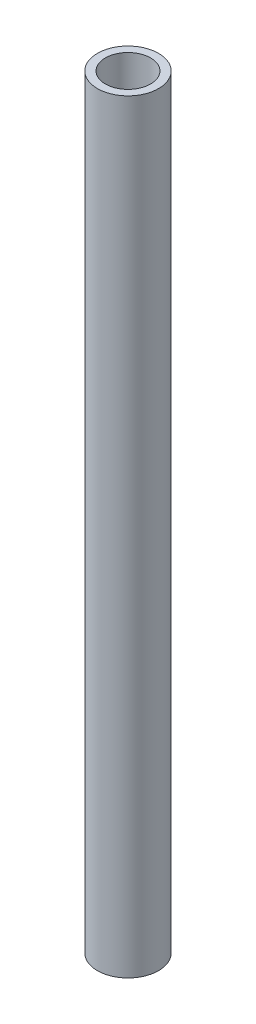
ISO-10303-21;
HEADER;
FILE_DESCRIPTION(('STEP AP214'),'2;1');
FILE_NAME('part.step','',(''),(''),'','','');
FILE_SCHEMA(('AUTOMOTIVE_DESIGN { 1 0 10303 214 1 1 1 1 }'));
ENDSEC;
DATA;
#1=APPLICATION_CONTEXT('core data for automotive mechanical design processes');
#2=APPLICATION_PROTOCOL_DEFINITION('international standard','automotive_design',2000,#1);
#3=PRODUCT_CONTEXT('',#1,'mechanical');
#4=PRODUCT('Part','Part','',(#3));
#5=PRODUCT_RELATED_PRODUCT_CATEGORY('part','',(#4));
#6=PRODUCT_DEFINITION_FORMATION('','',#4);
#7=PRODUCT_DEFINITION_CONTEXT('part definition',#1,'design');
#8=PRODUCT_DEFINITION('design','',#6,#7);
#9=PRODUCT_DEFINITION_SHAPE('','',#8);
#10=(LENGTH_UNIT() NAMED_UNIT(*) SI_UNIT(.MILLI.,.METRE.));
#11=(NAMED_UNIT(*) PLANE_ANGLE_UNIT() SI_UNIT($,.RADIAN.));
#12=(NAMED_UNIT(*) SI_UNIT($,.STERADIAN.) SOLID_ANGLE_UNIT());
#13=UNCERTAINTY_MEASURE_WITH_UNIT(LENGTH_MEASURE(1.E-05),#10,'distance_accuracy_value','');
#14=(GEOMETRIC_REPRESENTATION_CONTEXT(3) GLOBAL_UNCERTAINTY_ASSIGNED_CONTEXT((#13)) GLOBAL_UNIT_ASSIGNED_CONTEXT((#10,
#11,#12)) REPRESENTATION_CONTEXT('',''));
#15=CARTESIAN_POINT('',(0.,0.,0.));
#16=DIRECTION('',(0.,0.,1.));
#17=DIRECTION('',(1.,0.,0.));
#18=AXIS2_PLACEMENT_3D('',#15,#16,#17);
#19=CARTESIAN_POINT('',(0.,266.7,0.));
#20=DIRECTION('',(0.,1.,0.));
#21=DIRECTION('',(0.,0.,1.));
#22=AXIS2_PLACEMENT_3D('',#19,#20,#21);
#23=PLANE('',#22);
#24=CARTESIAN_POINT('',(0.,266.7,0.));
#25=DIRECTION('',(0.,1.,0.));
#26=DIRECTION('',(0.,0.,1.));
#27=AXIS2_PLACEMENT_3D('',#24,#25,#26);
#28=CIRCLE('',#27,10.668);
#29=CARTESIAN_POINT('',(0.,266.7,10.668));
#30=VERTEX_POINT('',#29);
#31=EDGE_CURVE('E10',#30,#30,#28,.T.);
#32=ORIENTED_EDGE('',*,*,#31,.T.);
#33=EDGE_LOOP('',(#32));
#34=FACE_BOUND('',#33,.T.);
#35=CARTESIAN_POINT('',(0.,266.7,0.));
#36=DIRECTION('',(0.,1.,0.));
#37=DIRECTION('',(0.,0.,1.));
#38=AXIS2_PLACEMENT_3D('',#35,#36,#37);
#39=CIRCLE('',#38,7.8994);
#40=CARTESIAN_POINT('',(0.,266.7,7.8994));
#41=VERTEX_POINT('',#40);
#42=EDGE_CURVE('E43',#41,#41,#39,.T.);
#43=ORIENTED_EDGE('',*,*,#42,.F.);
#44=EDGE_LOOP('',(#43));
#45=FACE_BOUND('',#44,.T.);
#46=ADVANCED_FACE('F32',(#34,#45),#23,.T.);
#47=CARTESIAN_POINT('',(0.,0.,0.));
#48=DIRECTION('',(0.,1.,0.));
#49=DIRECTION('',(0.,0.,1.));
#50=AXIS2_PLACEMENT_3D('',#47,#48,#49);
#51=PLANE('',#50);
#52=CARTESIAN_POINT('',(0.,0.,0.));
#53=DIRECTION('',(0.,1.,0.));
#54=DIRECTION('',(0.,0.,1.));
#55=AXIS2_PLACEMENT_3D('',#52,#53,#54);
#56=CIRCLE('',#55,10.668);
#57=CARTESIAN_POINT('',(0.,0.,10.668));
#58=VERTEX_POINT('',#57);
#59=EDGE_CURVE('E36',#58,#58,#56,.T.);
#60=ORIENTED_EDGE('',*,*,#59,.F.);
#61=EDGE_LOOP('',(#60));
#62=FACE_BOUND('',#61,.T.);
#63=CARTESIAN_POINT('',(0.,0.,0.));
#64=DIRECTION('',(0.,1.,0.));
#65=DIRECTION('',(0.,0.,1.));
#66=AXIS2_PLACEMENT_3D('',#63,#64,#65);
#67=CIRCLE('',#66,7.8994);
#68=CARTESIAN_POINT('',(0.,0.,7.8994));
#69=VERTEX_POINT('',#68);
#70=EDGE_CURVE('E45',#69,#69,#67,.T.);
#71=ORIENTED_EDGE('',*,*,#70,.T.);
#72=EDGE_LOOP('',(#71));
#73=FACE_BOUND('',#72,.T.);
#74=ADVANCED_FACE('F55',(#62,#73),#51,.F.);
#75=CARTESIAN_POINT('',(0.,266.7,0.));
#76=DIRECTION('',(0.,-1.,0.));
#77=DIRECTION('',(0.,0.,-1.));
#78=AXIS2_PLACEMENT_3D('',#75,#76,#77);
#79=CYLINDRICAL_SURFACE('',#78,10.668);
#80=ORIENTED_EDGE('',*,*,#31,.F.);
#81=EDGE_LOOP('',(#80));
#82=FACE_BOUND('',#81,.T.);
#83=ORIENTED_EDGE('',*,*,#59,.T.);
#84=EDGE_LOOP('',(#83));
#85=FACE_BOUND('',#84,.T.);
#86=ADVANCED_FACE('F34',(#82,#85),#79,.T.);
#87=CARTESIAN_POINT('',(0.,266.7,0.));
#88=DIRECTION('',(0.,-1.,0.));
#89=DIRECTION('',(0.,0.,-1.));
#90=AXIS2_PLACEMENT_3D('',#87,#88,#89);
#91=CYLINDRICAL_SURFACE('',#90,7.8994);
#92=ORIENTED_EDGE('',*,*,#42,.T.);
#93=EDGE_LOOP('',(#92));
#94=FACE_BOUND('',#93,.T.);
#95=ORIENTED_EDGE('',*,*,#70,.F.);
#96=EDGE_LOOP('',(#95));
#97=FACE_BOUND('',#96,.T.);
#98=ADVANCED_FACE('F51',(#94,#97),#91,.F.);
#99=CLOSED_SHELL('',(#46,#74,#86,#98));
#100=MANIFOLD_SOLID_BREP('B2',#99);
#101=ADVANCED_BREP_SHAPE_REPRESENTATION('',(#18,#100),#14);
#102=SHAPE_DEFINITION_REPRESENTATION(#9,#101);
ENDSEC;
END-ISO-10303-21;
